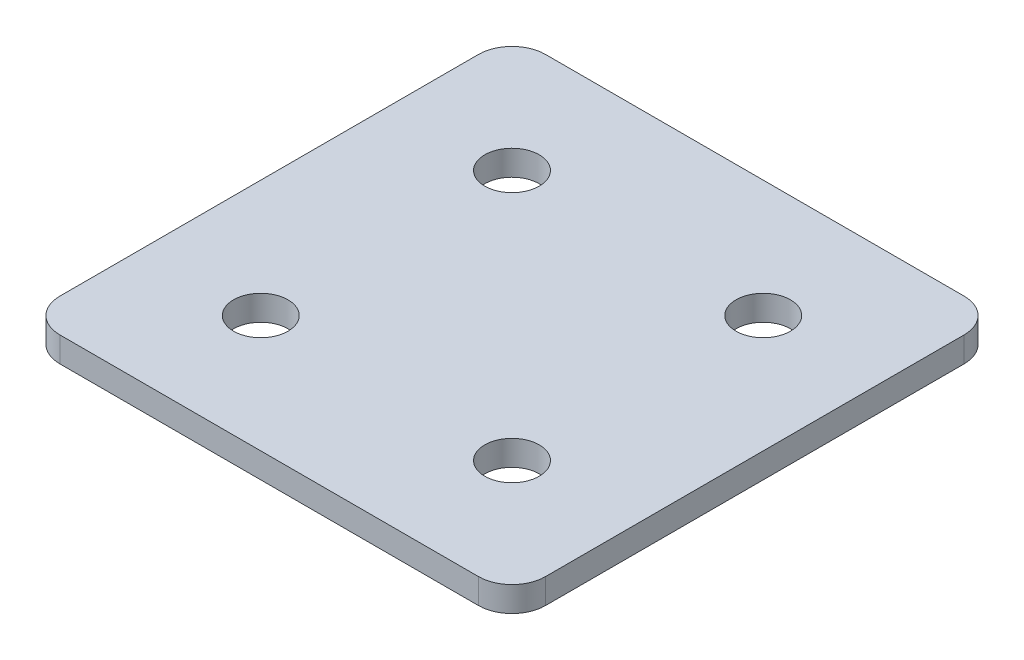
ISO-10303-21;
HEADER;
FILE_DESCRIPTION(('STEP AP214'),'2;1');
FILE_NAME('part.step','',(''),(''),'','','');
FILE_SCHEMA(('AUTOMOTIVE_DESIGN { 1 0 10303 214 1 1 1 1 }'));
ENDSEC;
DATA;
#1=APPLICATION_CONTEXT('core data for automotive mechanical design processes');
#2=APPLICATION_PROTOCOL_DEFINITION('international standard','automotive_design',2000,#1);
#3=PRODUCT_CONTEXT('',#1,'mechanical');
#4=PRODUCT('Part','Part','',(#3));
#5=PRODUCT_RELATED_PRODUCT_CATEGORY('part','',(#4));
#6=PRODUCT_DEFINITION_FORMATION('','',#4);
#7=PRODUCT_DEFINITION_CONTEXT('part definition',#1,'design');
#8=PRODUCT_DEFINITION('design','',#6,#7);
#9=PRODUCT_DEFINITION_SHAPE('','',#8);
#10=(LENGTH_UNIT() NAMED_UNIT(*) SI_UNIT(.MILLI.,.METRE.));
#11=(NAMED_UNIT(*) PLANE_ANGLE_UNIT() SI_UNIT($,.RADIAN.));
#12=(NAMED_UNIT(*) SI_UNIT($,.STERADIAN.) SOLID_ANGLE_UNIT());
#13=UNCERTAINTY_MEASURE_WITH_UNIT(LENGTH_MEASURE(1.E-05),#10,'distance_accuracy_value','');
#14=(GEOMETRIC_REPRESENTATION_CONTEXT(3) GLOBAL_UNCERTAINTY_ASSIGNED_CONTEXT((#13)) GLOBAL_UNIT_ASSIGNED_CONTEXT((#10,
#11,#12)) REPRESENTATION_CONTEXT('',''));
#15=CARTESIAN_POINT('',(0.,0.,0.));
#16=DIRECTION('',(0.,0.,1.));
#17=DIRECTION('',(1.,0.,0.));
#18=AXIS2_PLACEMENT_3D('',#15,#16,#17);
#19=CARTESIAN_POINT('',(-1.42451364331464,1.52470932668439,-8.3498260094711));
#20=DIRECTION('',(0.,-1.,0.));
#21=DIRECTION('',(0.,0.,-1.));
#22=AXIS2_PLACEMENT_3D('',#19,#20,#21);
#23=PLANE('',#22);
#24=CARTESIAN_POINT('',(6.07548635668537,1.52470932668439,6.6501739905289));
#25=DIRECTION('',(0.,1.,0.));
#26=DIRECTION('',(0.,0.,1.));
#27=AXIS2_PLACEMENT_3D('',#24,#25,#26);
#28=CIRCLE('',#27,1.625);
#29=CARTESIAN_POINT('',(6.07548635668537,1.52470932668439,8.2751739905289));
#30=VERTEX_POINT('',#29);
#31=EDGE_CURVE('E165',#30,#30,#28,.T.);
#32=ORIENTED_EDGE('',*,*,#31,.T.);
#33=EDGE_LOOP('',(#32));
#34=FACE_BOUND('',#33,.T.);
#35=CARTESIAN_POINT('',(-8.92451364331467,1.52470932668439,6.6501739905289));
#36=DIRECTION('',(0.,1.,0.));
#37=DIRECTION('',(0.,0.,1.));
#38=AXIS2_PLACEMENT_3D('',#35,#36,#37);
#39=CIRCLE('',#38,1.625);
#40=CARTESIAN_POINT('',(-8.92451364331467,1.52470932668439,8.2751739905289));
#41=VERTEX_POINT('',#40);
#42=EDGE_CURVE('E159',#41,#41,#39,.T.);
#43=ORIENTED_EDGE('',*,*,#42,.T.);
#44=EDGE_LOOP('',(#43));
#45=FACE_BOUND('',#44,.T.);
#46=CARTESIAN_POINT('',(6.07548635668537,1.52470932668439,-8.3498260094711));
#47=DIRECTION('',(0.,1.,0.));
#48=DIRECTION('',(0.,0.,1.));
#49=AXIS2_PLACEMENT_3D('',#46,#47,#48);
#50=CIRCLE('',#49,1.625);
#51=CARTESIAN_POINT('',(6.07548635668537,1.52470932668439,-6.7248260094711));
#52=VERTEX_POINT('',#51);
#53=EDGE_CURVE('E154',#52,#52,#50,.T.);
#54=ORIENTED_EDGE('',*,*,#53,.T.);
#55=EDGE_LOOP('',(#54));
#56=FACE_BOUND('',#55,.T.);
#57=CARTESIAN_POINT('',(-8.92451364331467,1.52470932668439,-8.3498260094711));
#58=DIRECTION('',(0.,1.,0.));
#59=DIRECTION('',(0.,0.,1.));
#60=AXIS2_PLACEMENT_3D('',#57,#58,#59);
#61=CIRCLE('',#60,1.625);
#62=CARTESIAN_POINT('',(-8.92451364331467,1.52470932668439,-6.7248260094711));
#63=VERTEX_POINT('',#62);
#64=EDGE_CURVE('E147',#63,#63,#61,.T.);
#65=ORIENTED_EDGE('',*,*,#64,.T.);
#66=EDGE_LOOP('',(#65));
#67=FACE_BOUND('',#66,.T.);
#68=DIRECTION('',(0.,0.,-1.));
#69=VECTOR('',#68,1.);
#70=CARTESIAN_POINT('',(13.0754863566855,1.52470932668439,13.6501739905289));
#71=LINE('',#70,#69);
#72=CARTESIAN_POINT('',(13.0754863566855,1.52470932668439,11.6501739905289));
#73=VERTEX_POINT('',#72);
#74=CARTESIAN_POINT('',(13.0754863566855,1.52470932668439,-13.3498260094711));
#75=VERTEX_POINT('',#74);
#76=EDGE_CURVE('E106',#73,#75,#71,.T.);
#77=ORIENTED_EDGE('',*,*,#76,.F.);
#78=CARTESIAN_POINT('',(11.0754863566855,1.52470932668439,11.6501739905289));
#79=DIRECTION('',(0.,-1.,0.));
#80=DIRECTION('',(0.,0.,-1.));
#81=AXIS2_PLACEMENT_3D('',#78,#79,#80);
#82=CIRCLE('',#81,2.);
#83=CARTESIAN_POINT('',(11.0754863566855,1.52470932668439,13.6501739905289));
#84=VERTEX_POINT('',#83);
#85=EDGE_CURVE('E128',#73,#84,#82,.T.);
#86=ORIENTED_EDGE('',*,*,#85,.T.);
#87=DIRECTION('',(1.,0.,0.));
#88=VECTOR('',#87,1.);
#89=CARTESIAN_POINT('',(-15.9245136433148,1.52470932668439,13.6501739905289));
#90=LINE('',#89,#88);
#91=CARTESIAN_POINT('',(-13.9245136433148,1.52470932668439,13.6501739905289));
#92=VERTEX_POINT('',#91);
#93=EDGE_CURVE('E110',#92,#84,#90,.T.);
#94=ORIENTED_EDGE('',*,*,#93,.F.);
#95=CARTESIAN_POINT('',(-13.9245136433148,1.52470932668439,11.6501739905289));
#96=DIRECTION('',(0.,-1.,0.));
#97=DIRECTION('',(0.,0.,-1.));
#98=AXIS2_PLACEMENT_3D('',#95,#96,#97);
#99=CIRCLE('',#98,2.);
#100=CARTESIAN_POINT('',(-15.9245136433148,1.52470932668439,11.6501739905289));
#101=VERTEX_POINT('',#100);
#102=EDGE_CURVE('E105',#92,#101,#99,.T.);
#103=ORIENTED_EDGE('',*,*,#102,.T.);
#104=DIRECTION('',(0.,0.,1.));
#105=VECTOR('',#104,1.);
#106=CARTESIAN_POINT('',(-15.9245136433148,1.52470932668439,-15.3498260094711));
#107=LINE('',#106,#105);
#108=CARTESIAN_POINT('',(-15.9245136433148,1.52470932668439,-13.3498260094711));
#109=VERTEX_POINT('',#108);
#110=EDGE_CURVE('E137',#109,#101,#107,.T.);
#111=ORIENTED_EDGE('',*,*,#110,.F.);
#112=CARTESIAN_POINT('',(-13.9245136433148,1.52470932668439,-13.3498260094711));
#113=DIRECTION('',(0.,-1.,0.));
#114=DIRECTION('',(0.,0.,-1.));
#115=AXIS2_PLACEMENT_3D('',#112,#113,#114);
#116=CIRCLE('',#115,2.);
#117=CARTESIAN_POINT('',(-13.9245136433148,1.52470932668439,-15.3498260094711));
#118=VERTEX_POINT('',#117);
#119=EDGE_CURVE('E31',#109,#118,#116,.T.);
#120=ORIENTED_EDGE('',*,*,#119,.T.);
#121=DIRECTION('',(-1.,0.,0.));
#122=VECTOR('',#121,1.);
#123=CARTESIAN_POINT('',(13.0754863566855,1.52470932668439,-15.3498260094711));
#124=LINE('',#123,#122);
#125=CARTESIAN_POINT('',(11.0754863566855,1.52470932668439,-15.3498260094711));
#126=VERTEX_POINT('',#125);
#127=EDGE_CURVE('E138',#126,#118,#124,.T.);
#128=ORIENTED_EDGE('',*,*,#127,.F.);
#129=CARTESIAN_POINT('',(11.0754863566855,1.52470932668439,-13.3498260094711));
#130=DIRECTION('',(0.,-1.,0.));
#131=DIRECTION('',(0.,0.,-1.));
#132=AXIS2_PLACEMENT_3D('',#129,#130,#131);
#133=CIRCLE('',#132,2.);
#134=EDGE_CURVE('E126',#126,#75,#133,.T.);
#135=ORIENTED_EDGE('',*,*,#134,.T.);
#136=EDGE_LOOP('',(#77,#86,#94,#103,#111,#120,#128,#135));
#137=FACE_BOUND('',#136,.T.);
#138=ADVANCED_FACE('F16',(#34,#45,#56,#67,#137),#23,.T.);
#139=CARTESIAN_POINT('',(13.0754863566855,1.52470932668439,-15.3498260094711));
#140=DIRECTION('',(0.,0.,-1.));
#141=DIRECTION('',(-1.,0.,0.));
#142=AXIS2_PLACEMENT_3D('',#139,#140,#141);
#143=PLANE('',#142);
#144=DIRECTION('',(-1.,0.,0.));
#145=VECTOR('',#144,1.);
#146=CARTESIAN_POINT('',(13.0754863566855,3.02470932668439,-15.3498260094711));
#147=LINE('',#146,#145);
#148=CARTESIAN_POINT('',(11.0754863566855,3.02470932668439,-15.3498260094711));
#149=VERTEX_POINT('',#148);
#150=CARTESIAN_POINT('',(-13.9245136433148,3.02470932668439,-15.3498260094711));
#151=VERTEX_POINT('',#150);
#152=EDGE_CURVE('E144',#149,#151,#147,.T.);
#153=ORIENTED_EDGE('',*,*,#152,.F.);
#154=DIRECTION('',(0.,1.,0.));
#155=VECTOR('',#154,1.);
#156=CARTESIAN_POINT('',(11.0754863566855,1.52470932668439,-15.3498260094711));
#157=LINE('',#156,#155);
#158=EDGE_CURVE('E38',#149,#126,#157,.F.);
#159=ORIENTED_EDGE('',*,*,#158,.T.);
#160=ORIENTED_EDGE('',*,*,#127,.T.);
#161=DIRECTION('',(0.,1.,0.));
#162=VECTOR('',#161,1.);
#163=CARTESIAN_POINT('',(-13.9245136433148,1.52470932668439,-15.3498260094711));
#164=LINE('',#163,#162);
#165=EDGE_CURVE('E130',#118,#151,#164,.T.);
#166=ORIENTED_EDGE('',*,*,#165,.T.);
#167=EDGE_LOOP('',(#153,#159,#160,#166));
#168=FACE_BOUND('',#167,.T.);
#169=ADVANCED_FACE('F206',(#168),#143,.T.);
#170=CARTESIAN_POINT('',(13.0754863566855,1.52470932668439,13.6501739905289));
#171=DIRECTION('',(1.,0.,0.));
#172=DIRECTION('',(0.,0.,-1.));
#173=AXIS2_PLACEMENT_3D('',#170,#171,#172);
#174=PLANE('',#173);
#175=DIRECTION('',(0.,0.,-1.));
#176=VECTOR('',#175,1.);
#177=CARTESIAN_POINT('',(13.0754863566855,3.02470932668439,13.6501739905289));
#178=LINE('',#177,#176);
#179=CARTESIAN_POINT('',(13.0754863566855,3.02470932668439,11.6501739905289));
#180=VERTEX_POINT('',#179);
#181=CARTESIAN_POINT('',(13.0754863566855,3.02470932668439,-13.3498260094711));
#182=VERTEX_POINT('',#181);
#183=EDGE_CURVE('E102',#180,#182,#178,.T.);
#184=ORIENTED_EDGE('',*,*,#183,.F.);
#185=DIRECTION('',(0.,1.,0.));
#186=VECTOR('',#185,1.);
#187=CARTESIAN_POINT('',(13.0754863566855,1.52470932668439,11.6501739905289));
#188=LINE('',#187,#186);
#189=EDGE_CURVE('E122',#180,#73,#188,.F.);
#190=ORIENTED_EDGE('',*,*,#189,.T.);
#191=ORIENTED_EDGE('',*,*,#76,.T.);
#192=DIRECTION('',(0.,1.,0.));
#193=VECTOR('',#192,1.);
#194=CARTESIAN_POINT('',(13.0754863566855,1.52470932668439,-13.3498260094711));
#195=LINE('',#194,#193);
#196=EDGE_CURVE('E119',#75,#182,#195,.T.);
#197=ORIENTED_EDGE('',*,*,#196,.T.);
#198=EDGE_LOOP('',(#184,#190,#191,#197));
#199=FACE_BOUND('',#198,.T.);
#200=ADVANCED_FACE('F211',(#199),#174,.T.);
#201=CARTESIAN_POINT('',(-15.9245136433148,1.52470932668439,13.6501739905289));
#202=DIRECTION('',(0.,0.,1.));
#203=DIRECTION('',(1.,0.,0.));
#204=AXIS2_PLACEMENT_3D('',#201,#202,#203);
#205=PLANE('',#204);
#206=ORIENTED_EDGE('',*,*,#93,.T.);
#207=DIRECTION('',(0.,1.,0.));
#208=VECTOR('',#207,1.);
#209=CARTESIAN_POINT('',(11.0754863566855,1.52470932668439,13.6501739905289));
#210=LINE('',#209,#208);
#211=CARTESIAN_POINT('',(11.0754863566855,3.02470932668439,13.6501739905289));
#212=VERTEX_POINT('',#211);
#213=EDGE_CURVE('E93',#84,#212,#210,.T.);
#214=ORIENTED_EDGE('',*,*,#213,.T.);
#215=DIRECTION('',(1.,0.,0.));
#216=VECTOR('',#215,1.);
#217=CARTESIAN_POINT('',(-15.9245136433148,3.02470932668439,13.6501739905289));
#218=LINE('',#217,#216);
#219=CARTESIAN_POINT('',(-13.9245136433148,3.02470932668439,13.6501739905289));
#220=VERTEX_POINT('',#219);
#221=EDGE_CURVE('E85',#220,#212,#218,.T.);
#222=ORIENTED_EDGE('',*,*,#221,.F.);
#223=DIRECTION('',(0.,1.,0.));
#224=VECTOR('',#223,1.);
#225=CARTESIAN_POINT('',(-13.9245136433148,1.52470932668439,13.6501739905289));
#226=LINE('',#225,#224);
#227=EDGE_CURVE('E99',#220,#92,#226,.F.);
#228=ORIENTED_EDGE('',*,*,#227,.T.);
#229=EDGE_LOOP('',(#206,#214,#222,#228));
#230=FACE_BOUND('',#229,.T.);
#231=ADVANCED_FACE('F98',(#230),#205,.T.);
#232=CARTESIAN_POINT('',(-15.9245136433148,1.52470932668439,-15.3498260094711));
#233=DIRECTION('',(-1.,0.,0.));
#234=DIRECTION('',(0.,0.,1.));
#235=AXIS2_PLACEMENT_3D('',#232,#233,#234);
#236=PLANE('',#235);
#237=DIRECTION('',(0.,0.,1.));
#238=VECTOR('',#237,1.);
#239=CARTESIAN_POINT('',(-15.9245136433148,3.02470932668439,-15.3498260094711));
#240=LINE('',#239,#238);
#241=CARTESIAN_POINT('',(-15.9245136433148,3.02470932668439,-13.3498260094711));
#242=VERTEX_POINT('',#241);
#243=CARTESIAN_POINT('',(-15.9245136433148,3.02470932668439,11.6501739905289));
#244=VERTEX_POINT('',#243);
#245=EDGE_CURVE('E87',#242,#244,#240,.T.);
#246=ORIENTED_EDGE('',*,*,#245,.F.);
#247=DIRECTION('',(0.,1.,0.));
#248=VECTOR('',#247,1.);
#249=CARTESIAN_POINT('',(-15.9245136433148,1.52470932668439,-13.3498260094711));
#250=LINE('',#249,#248);
#251=EDGE_CURVE('E10',#242,#109,#250,.F.);
#252=ORIENTED_EDGE('',*,*,#251,.T.);
#253=ORIENTED_EDGE('',*,*,#110,.T.);
#254=DIRECTION('',(0.,1.,0.));
#255=VECTOR('',#254,1.);
#256=CARTESIAN_POINT('',(-15.9245136433148,1.52470932668439,11.6501739905289));
#257=LINE('',#256,#255);
#258=EDGE_CURVE('E24',#101,#244,#257,.T.);
#259=ORIENTED_EDGE('',*,*,#258,.T.);
#260=EDGE_LOOP('',(#246,#252,#253,#259));
#261=FACE_BOUND('',#260,.T.);
#262=ADVANCED_FACE('F135',(#261),#236,.T.);
#263=CARTESIAN_POINT('',(-1.42451364331464,3.02470932668439,-8.3498260094711));
#264=DIRECTION('',(0.,-1.,0.));
#265=DIRECTION('',(0.,0.,-1.));
#266=AXIS2_PLACEMENT_3D('',#263,#264,#265);
#267=PLANE('',#266);
#268=CARTESIAN_POINT('',(6.07548635668537,3.02470932668439,6.6501739905289));
#269=DIRECTION('',(0.,1.,0.));
#270=DIRECTION('',(0.,0.,1.));
#271=AXIS2_PLACEMENT_3D('',#268,#269,#270);
#272=CIRCLE('',#271,1.625);
#273=CARTESIAN_POINT('',(6.07548635668537,3.02470932668439,8.2751739905289));
#274=VERTEX_POINT('',#273);
#275=EDGE_CURVE('E168',#274,#274,#272,.T.);
#276=ORIENTED_EDGE('',*,*,#275,.F.);
#277=EDGE_LOOP('',(#276));
#278=FACE_BOUND('',#277,.T.);
#279=CARTESIAN_POINT('',(-8.92451364331467,3.02470932668439,6.6501739905289));
#280=DIRECTION('',(0.,1.,0.));
#281=DIRECTION('',(0.,0.,1.));
#282=AXIS2_PLACEMENT_3D('',#279,#280,#281);
#283=CIRCLE('',#282,1.625);
#284=CARTESIAN_POINT('',(-8.92451364331467,3.02470932668439,8.2751739905289));
#285=VERTEX_POINT('',#284);
#286=EDGE_CURVE('E162',#285,#285,#283,.T.);
#287=ORIENTED_EDGE('',*,*,#286,.F.);
#288=EDGE_LOOP('',(#287));
#289=FACE_BOUND('',#288,.T.);
#290=CARTESIAN_POINT('',(6.07548635668537,3.02470932668439,-8.3498260094711));
#291=DIRECTION('',(0.,1.,0.));
#292=DIRECTION('',(0.,0.,1.));
#293=AXIS2_PLACEMENT_3D('',#290,#291,#292);
#294=CIRCLE('',#293,1.625);
#295=CARTESIAN_POINT('',(6.07548635668537,3.02470932668439,-6.7248260094711));
#296=VERTEX_POINT('',#295);
#297=EDGE_CURVE('E156',#296,#296,#294,.T.);
#298=ORIENTED_EDGE('',*,*,#297,.F.);
#299=EDGE_LOOP('',(#298));
#300=FACE_BOUND('',#299,.T.);
#301=CARTESIAN_POINT('',(-8.92451364331467,3.02470932668439,-8.3498260094711));
#302=DIRECTION('',(0.,1.,0.));
#303=DIRECTION('',(0.,0.,1.));
#304=AXIS2_PLACEMENT_3D('',#301,#302,#303);
#305=CIRCLE('',#304,1.625);
#306=CARTESIAN_POINT('',(-8.92451364331467,3.02470932668439,-6.7248260094711));
#307=VERTEX_POINT('',#306);
#308=EDGE_CURVE('E149',#307,#307,#305,.T.);
#309=ORIENTED_EDGE('',*,*,#308,.F.);
#310=EDGE_LOOP('',(#309));
#311=FACE_BOUND('',#310,.T.);
#312=ORIENTED_EDGE('',*,*,#221,.T.);
#313=CARTESIAN_POINT('',(11.0754863566855,3.02470932668439,11.6501739905289));
#314=DIRECTION('',(0.,-1.,0.));
#315=DIRECTION('',(0.,0.,-1.));
#316=AXIS2_PLACEMENT_3D('',#313,#314,#315);
#317=CIRCLE('',#316,2.);
#318=EDGE_CURVE('E117',#212,#180,#317,.F.);
#319=ORIENTED_EDGE('',*,*,#318,.T.);
#320=ORIENTED_EDGE('',*,*,#183,.T.);
#321=CARTESIAN_POINT('',(11.0754863566855,3.02470932668439,-13.3498260094711));
#322=DIRECTION('',(0.,-1.,0.));
#323=DIRECTION('',(0.,0.,-1.));
#324=AXIS2_PLACEMENT_3D('',#321,#322,#323);
#325=CIRCLE('',#324,2.);
#326=EDGE_CURVE('E115',#182,#149,#325,.F.);
#327=ORIENTED_EDGE('',*,*,#326,.T.);
#328=ORIENTED_EDGE('',*,*,#152,.T.);
#329=CARTESIAN_POINT('',(-13.9245136433148,3.02470932668439,-13.3498260094711));
#330=DIRECTION('',(0.,-1.,0.));
#331=DIRECTION('',(0.,0.,-1.));
#332=AXIS2_PLACEMENT_3D('',#329,#330,#331);
#333=CIRCLE('',#332,2.);
#334=EDGE_CURVE('E92',#151,#242,#333,.F.);
#335=ORIENTED_EDGE('',*,*,#334,.T.);
#336=ORIENTED_EDGE('',*,*,#245,.T.);
#337=CARTESIAN_POINT('',(-13.9245136433148,3.02470932668439,11.6501739905289));
#338=DIRECTION('',(0.,-1.,0.));
#339=DIRECTION('',(0.,0.,-1.));
#340=AXIS2_PLACEMENT_3D('',#337,#338,#339);
#341=CIRCLE('',#340,2.);
#342=EDGE_CURVE('E82',#244,#220,#341,.F.);
#343=ORIENTED_EDGE('',*,*,#342,.T.);
#344=EDGE_LOOP('',(#312,#319,#320,#327,#328,#335,#336,#343));
#345=FACE_BOUND('',#344,.T.);
#346=ADVANCED_FACE('F84',(#278,#289,#300,#311,#345),#267,.F.);
#347=CARTESIAN_POINT('',(-8.92451364331467,1.52470932668439,-8.3498260094711));
#348=DIRECTION('',(0.,1.,0.));
#349=DIRECTION('',(0.,0.,1.));
#350=AXIS2_PLACEMENT_3D('',#347,#348,#349);
#351=CYLINDRICAL_SURFACE('',#350,1.625);
#352=ORIENTED_EDGE('',*,*,#64,.F.);
#353=EDGE_LOOP('',(#352));
#354=FACE_BOUND('',#353,.T.);
#355=ORIENTED_EDGE('',*,*,#308,.T.);
#356=EDGE_LOOP('',(#355));
#357=FACE_BOUND('',#356,.T.);
#358=ADVANCED_FACE('F186',(#354,#357),#351,.F.);
#359=CARTESIAN_POINT('',(6.07548635668537,1.52470932668439,-8.3498260094711));
#360=DIRECTION('',(0.,1.,0.));
#361=DIRECTION('',(0.,0.,1.));
#362=AXIS2_PLACEMENT_3D('',#359,#360,#361);
#363=CYLINDRICAL_SURFACE('',#362,1.625);
#364=ORIENTED_EDGE('',*,*,#53,.F.);
#365=EDGE_LOOP('',(#364));
#366=FACE_BOUND('',#365,.T.);
#367=ORIENTED_EDGE('',*,*,#297,.T.);
#368=EDGE_LOOP('',(#367));
#369=FACE_BOUND('',#368,.T.);
#370=ADVANCED_FACE('F195',(#366,#369),#363,.F.);
#371=CARTESIAN_POINT('',(-8.92451364331467,1.52470932668439,6.6501739905289));
#372=DIRECTION('',(0.,1.,0.));
#373=DIRECTION('',(0.,0.,1.));
#374=AXIS2_PLACEMENT_3D('',#371,#372,#373);
#375=CYLINDRICAL_SURFACE('',#374,1.625);
#376=ORIENTED_EDGE('',*,*,#42,.F.);
#377=EDGE_LOOP('',(#376));
#378=FACE_BOUND('',#377,.T.);
#379=ORIENTED_EDGE('',*,*,#286,.T.);
#380=EDGE_LOOP('',(#379));
#381=FACE_BOUND('',#380,.T.);
#382=ADVANCED_FACE('F180',(#378,#381),#375,.F.);
#383=CARTESIAN_POINT('',(6.07548635668537,1.52470932668439,6.6501739905289));
#384=DIRECTION('',(0.,1.,0.));
#385=DIRECTION('',(0.,0.,1.));
#386=AXIS2_PLACEMENT_3D('',#383,#384,#385);
#387=CYLINDRICAL_SURFACE('',#386,1.625);
#388=ORIENTED_EDGE('',*,*,#31,.F.);
#389=EDGE_LOOP('',(#388));
#390=FACE_BOUND('',#389,.T.);
#391=ORIENTED_EDGE('',*,*,#275,.T.);
#392=EDGE_LOOP('',(#391));
#393=FACE_BOUND('',#392,.T.);
#394=ADVANCED_FACE('F176',(#390,#393),#387,.F.);
#395=CARTESIAN_POINT('',(11.0754863566855,1.52470932668439,11.6501739905289));
#396=DIRECTION('',(0.,1.,0.));
#397=DIRECTION('',(0.,0.,1.));
#398=AXIS2_PLACEMENT_3D('',#395,#396,#397);
#399=CYLINDRICAL_SURFACE('',#398,2.);
#400=ORIENTED_EDGE('',*,*,#85,.F.);
#401=ORIENTED_EDGE('',*,*,#189,.F.);
#402=ORIENTED_EDGE('',*,*,#318,.F.);
#403=ORIENTED_EDGE('',*,*,#213,.F.);
#404=EDGE_LOOP('',(#400,#401,#402,#403));
#405=FACE_BOUND('',#404,.T.);
#406=ADVANCED_FACE('F179',(#405),#399,.T.);
#407=CARTESIAN_POINT('',(11.0754863566855,1.52470932668439,-13.3498260094711));
#408=DIRECTION('',(0.,1.,0.));
#409=DIRECTION('',(0.,0.,1.));
#410=AXIS2_PLACEMENT_3D('',#407,#408,#409);
#411=CYLINDRICAL_SURFACE('',#410,2.);
#412=ORIENTED_EDGE('',*,*,#134,.F.);
#413=ORIENTED_EDGE('',*,*,#158,.F.);
#414=ORIENTED_EDGE('',*,*,#326,.F.);
#415=ORIENTED_EDGE('',*,*,#196,.F.);
#416=EDGE_LOOP('',(#412,#413,#414,#415));
#417=FACE_BOUND('',#416,.T.);
#418=ADVANCED_FACE('F216',(#417),#411,.T.);
#419=CARTESIAN_POINT('',(-13.9245136433148,1.52470932668439,-13.3498260094711));
#420=DIRECTION('',(0.,1.,0.));
#421=DIRECTION('',(0.,0.,1.));
#422=AXIS2_PLACEMENT_3D('',#419,#420,#421);
#423=CYLINDRICAL_SURFACE('',#422,2.);
#424=ORIENTED_EDGE('',*,*,#119,.F.);
#425=ORIENTED_EDGE('',*,*,#251,.F.);
#426=ORIENTED_EDGE('',*,*,#334,.F.);
#427=ORIENTED_EDGE('',*,*,#165,.F.);
#428=EDGE_LOOP('',(#424,#425,#426,#427));
#429=FACE_BOUND('',#428,.T.);
#430=ADVANCED_FACE('F219',(#429),#423,.T.);
#431=CARTESIAN_POINT('',(-13.9245136433148,1.52470932668439,11.6501739905289));
#432=DIRECTION('',(0.,1.,0.));
#433=DIRECTION('',(0.,0.,1.));
#434=AXIS2_PLACEMENT_3D('',#431,#432,#433);
#435=CYLINDRICAL_SURFACE('',#434,2.);
#436=ORIENTED_EDGE('',*,*,#102,.F.);
#437=ORIENTED_EDGE('',*,*,#227,.F.);
#438=ORIENTED_EDGE('',*,*,#342,.F.);
#439=ORIENTED_EDGE('',*,*,#258,.F.);
#440=EDGE_LOOP('',(#436,#437,#438,#439));
#441=FACE_BOUND('',#440,.T.);
#442=ADVANCED_FACE('F18',(#441),#435,.T.);
#443=CLOSED_SHELL('',(#138,#169,#200,#231,#262,#346,#358,#370,#382,#394,#406,#418,#430,#442));
#444=MANIFOLD_SOLID_BREP('B1',#443);
#445=ADVANCED_BREP_SHAPE_REPRESENTATION('',(#18,#444),#14);
#446=SHAPE_DEFINITION_REPRESENTATION(#9,#445);
ENDSEC;
END-ISO-10303-21;
